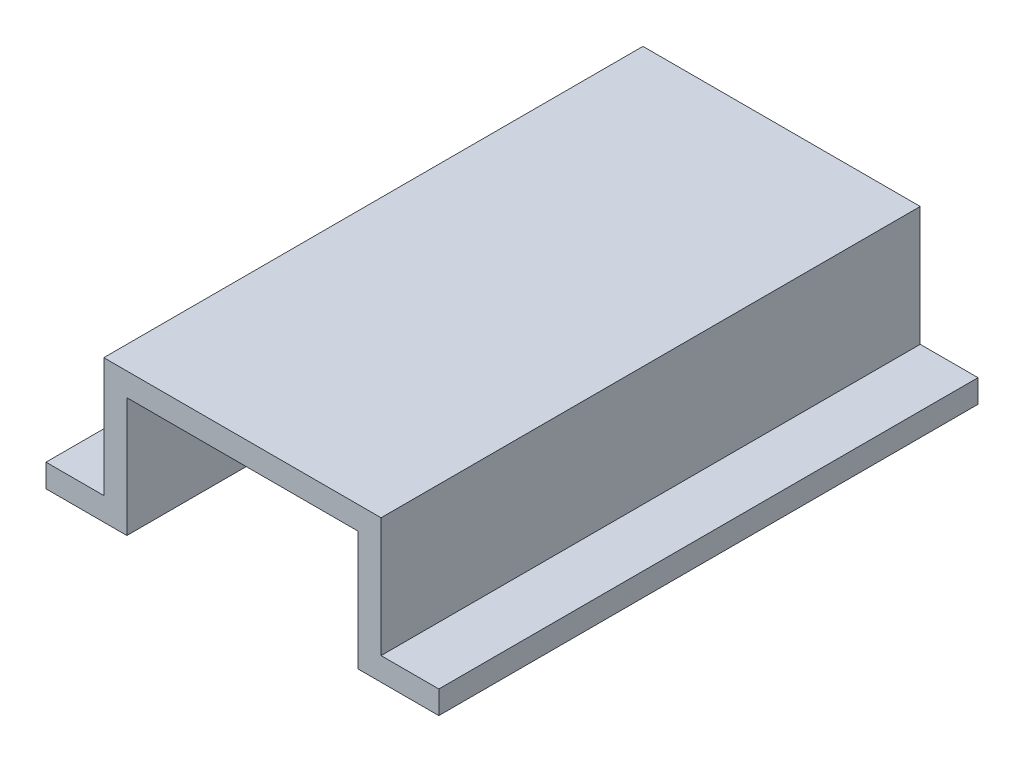
ISO-10303-21;
HEADER;
FILE_DESCRIPTION(('STEP AP214'),'2;1');
FILE_NAME('part.step','',(''),(''),'','','');
FILE_SCHEMA(('AUTOMOTIVE_DESIGN { 1 0 10303 214 1 1 1 1 }'));
ENDSEC;
DATA;
#1=APPLICATION_CONTEXT('core data for automotive mechanical design processes');
#2=APPLICATION_PROTOCOL_DEFINITION('international standard','automotive_design',2000,#1);
#3=PRODUCT_CONTEXT('',#1,'mechanical');
#4=PRODUCT('Part','Part','',(#3));
#5=PRODUCT_RELATED_PRODUCT_CATEGORY('part','',(#4));
#6=PRODUCT_DEFINITION_FORMATION('','',#4);
#7=PRODUCT_DEFINITION_CONTEXT('part definition',#1,'design');
#8=PRODUCT_DEFINITION('design','',#6,#7);
#9=PRODUCT_DEFINITION_SHAPE('','',#8);
#10=(LENGTH_UNIT() NAMED_UNIT(*) SI_UNIT(.MILLI.,.METRE.));
#11=(NAMED_UNIT(*) PLANE_ANGLE_UNIT() SI_UNIT($,.RADIAN.));
#12=(NAMED_UNIT(*) SI_UNIT($,.STERADIAN.) SOLID_ANGLE_UNIT());
#13=UNCERTAINTY_MEASURE_WITH_UNIT(LENGTH_MEASURE(1.E-05),#10,'distance_accuracy_value','');
#14=(GEOMETRIC_REPRESENTATION_CONTEXT(3) GLOBAL_UNCERTAINTY_ASSIGNED_CONTEXT((#13)) GLOBAL_UNIT_ASSIGNED_CONTEXT((#10,
#11,#12)) REPRESENTATION_CONTEXT('',''));
#15=CARTESIAN_POINT('',(0.,0.,0.));
#16=DIRECTION('',(0.,0.,1.));
#17=DIRECTION('',(1.,0.,0.));
#18=AXIS2_PLACEMENT_3D('',#15,#16,#17);
#19=CARTESIAN_POINT('',(0.,-6.,-140.));
#20=DIRECTION('',(1.,0.,0.));
#21=DIRECTION('',(0.,0.,1.));
#22=AXIS2_PLACEMENT_3D('',#19,#20,#21);
#23=PLANE('',#22);
#24=DIRECTION('',(0.,-1.,0.));
#25=VECTOR('',#24,1.);
#26=CARTESIAN_POINT('',(0.,-6.,0.));
#27=LINE('',#26,#25);
#28=CARTESIAN_POINT('',(0.,0.,0.));
#29=VERTEX_POINT('',#28);
#30=CARTESIAN_POINT('',(0.,-6.,0.));
#31=VERTEX_POINT('',#30);
#32=EDGE_CURVE('E157',#29,#31,#27,.T.);
#33=ORIENTED_EDGE('',*,*,#32,.F.);
#34=DIRECTION('',(0.,0.,1.));
#35=VECTOR('',#34,1.);
#36=CARTESIAN_POINT('',(0.,0.,-140.));
#37=LINE('',#36,#35);
#38=CARTESIAN_POINT('',(0.,0.,-140.));
#39=VERTEX_POINT('',#38);
#40=EDGE_CURVE('E156',#39,#29,#37,.T.);
#41=ORIENTED_EDGE('',*,*,#40,.F.);
#42=DIRECTION('',(0.,-1.,0.));
#43=VECTOR('',#42,1.);
#44=CARTESIAN_POINT('',(0.,-6.,-140.));
#45=LINE('',#44,#43);
#46=CARTESIAN_POINT('',(0.,-6.,-140.));
#47=VERTEX_POINT('',#46);
#48=EDGE_CURVE('E187',#39,#47,#45,.T.);
#49=ORIENTED_EDGE('',*,*,#48,.T.);
#50=DIRECTION('',(0.,0.,1.));
#51=VECTOR('',#50,1.);
#52=CARTESIAN_POINT('',(0.,-6.,-140.));
#53=LINE('',#52,#51);
#54=EDGE_CURVE('E11',#47,#31,#53,.T.);
#55=ORIENTED_EDGE('',*,*,#54,.T.);
#56=EDGE_LOOP('',(#33,#41,#49,#55));
#57=FACE_BOUND('',#56,.T.);
#58=ADVANCED_FACE('F37',(#57),#23,.F.);
#59=CARTESIAN_POINT('',(21.,-6.,-140.));
#60=DIRECTION('',(0.,1.,0.));
#61=DIRECTION('',(-1.,0.,0.));
#62=AXIS2_PLACEMENT_3D('',#59,#60,#61);
#63=PLANE('',#62);
#64=DIRECTION('',(1.,0.,0.));
#65=VECTOR('',#64,1.);
#66=CARTESIAN_POINT('',(21.,-6.,0.));
#67=LINE('',#66,#65);
#68=CARTESIAN_POINT('',(21.,-6.,0.));
#69=VERTEX_POINT('',#68);
#70=EDGE_CURVE('E159',#31,#69,#67,.T.);
#71=ORIENTED_EDGE('',*,*,#70,.F.);
#72=ORIENTED_EDGE('',*,*,#54,.F.);
#73=DIRECTION('',(1.,0.,0.));
#74=VECTOR('',#73,1.);
#75=CARTESIAN_POINT('',(21.,-6.,-140.));
#76=LINE('',#75,#74);
#77=CARTESIAN_POINT('',(21.,-6.,-140.));
#78=VERTEX_POINT('',#77);
#79=EDGE_CURVE('E103',#47,#78,#76,.T.);
#80=ORIENTED_EDGE('',*,*,#79,.T.);
#81=DIRECTION('',(0.,0.,1.));
#82=VECTOR('',#81,1.);
#83=CARTESIAN_POINT('',(21.,-6.,-140.));
#84=LINE('',#83,#82);
#85=EDGE_CURVE('E45',#78,#69,#84,.T.);
#86=ORIENTED_EDGE('',*,*,#85,.T.);
#87=EDGE_LOOP('',(#71,#72,#80,#86));
#88=FACE_BOUND('',#87,.T.);
#89=ADVANCED_FACE('F211',(#88),#63,.F.);
#90=CARTESIAN_POINT('',(21.,25.,-140.));
#91=DIRECTION('',(-1.,0.,0.));
#92=DIRECTION('',(0.,-1.,0.));
#93=AXIS2_PLACEMENT_3D('',#90,#91,#92);
#94=PLANE('',#93);
#95=DIRECTION('',(0.,1.,0.));
#96=VECTOR('',#95,1.);
#97=CARTESIAN_POINT('',(21.,25.,0.));
#98=LINE('',#97,#96);
#99=CARTESIAN_POINT('',(21.,25.,0.));
#100=VERTEX_POINT('',#99);
#101=EDGE_CURVE('E162',#69,#100,#98,.T.);
#102=ORIENTED_EDGE('',*,*,#101,.F.);
#103=ORIENTED_EDGE('',*,*,#85,.F.);
#104=DIRECTION('',(0.,1.,0.));
#105=VECTOR('',#104,1.);
#106=CARTESIAN_POINT('',(21.,25.,-140.));
#107=LINE('',#106,#105);
#108=CARTESIAN_POINT('',(21.,25.,-140.));
#109=VERTEX_POINT('',#108);
#110=EDGE_CURVE('E220',#78,#109,#107,.T.);
#111=ORIENTED_EDGE('',*,*,#110,.T.);
#112=DIRECTION('',(0.,0.,1.));
#113=VECTOR('',#112,1.);
#114=CARTESIAN_POINT('',(21.,25.,-140.));
#115=LINE('',#114,#113);
#116=EDGE_CURVE('E206',#109,#100,#115,.T.);
#117=ORIENTED_EDGE('',*,*,#116,.T.);
#118=EDGE_LOOP('',(#102,#103,#111,#117));
#119=FACE_BOUND('',#118,.T.);
#120=ADVANCED_FACE('F254',(#119),#94,.F.);
#121=CARTESIAN_POINT('',(81.,25.,-140.));
#122=DIRECTION('',(0.,1.,0.));
#123=DIRECTION('',(-1.,0.,0.));
#124=AXIS2_PLACEMENT_3D('',#121,#122,#123);
#125=PLANE('',#124);
#126=DIRECTION('',(1.,0.,0.));
#127=VECTOR('',#126,1.);
#128=CARTESIAN_POINT('',(81.,25.,0.));
#129=LINE('',#128,#127);
#130=CARTESIAN_POINT('',(81.,25.,0.));
#131=VERTEX_POINT('',#130);
#132=EDGE_CURVE('E165',#100,#131,#129,.T.);
#133=ORIENTED_EDGE('',*,*,#132,.F.);
#134=ORIENTED_EDGE('',*,*,#116,.F.);
#135=DIRECTION('',(1.,0.,0.));
#136=VECTOR('',#135,1.);
#137=CARTESIAN_POINT('',(81.,25.,-140.));
#138=LINE('',#137,#136);
#139=CARTESIAN_POINT('',(81.,25.,-140.));
#140=VERTEX_POINT('',#139);
#141=EDGE_CURVE('E224',#109,#140,#138,.T.);
#142=ORIENTED_EDGE('',*,*,#141,.T.);
#143=DIRECTION('',(0.,0.,1.));
#144=VECTOR('',#143,1.);
#145=CARTESIAN_POINT('',(81.,25.,-140.));
#146=LINE('',#145,#144);
#147=EDGE_CURVE('E203',#140,#131,#146,.T.);
#148=ORIENTED_EDGE('',*,*,#147,.T.);
#149=EDGE_LOOP('',(#133,#134,#142,#148));
#150=FACE_BOUND('',#149,.T.);
#151=ADVANCED_FACE('F253',(#150),#125,.F.);
#152=CARTESIAN_POINT('',(81.,-6.,-140.));
#153=DIRECTION('',(1.,0.,0.));
#154=DIRECTION('',(0.,1.,0.));
#155=AXIS2_PLACEMENT_3D('',#152,#153,#154);
#156=PLANE('',#155);
#157=DIRECTION('',(0.,-1.,0.));
#158=VECTOR('',#157,1.);
#159=CARTESIAN_POINT('',(81.,-6.,0.));
#160=LINE('',#159,#158);
#161=CARTESIAN_POINT('',(81.,-6.,0.));
#162=VERTEX_POINT('',#161);
#163=EDGE_CURVE('E168',#131,#162,#160,.T.);
#164=ORIENTED_EDGE('',*,*,#163,.F.);
#165=ORIENTED_EDGE('',*,*,#147,.F.);
#166=DIRECTION('',(0.,-1.,0.));
#167=VECTOR('',#166,1.);
#168=CARTESIAN_POINT('',(81.,-6.,-140.));
#169=LINE('',#168,#167);
#170=CARTESIAN_POINT('',(81.,-6.,-140.));
#171=VERTEX_POINT('',#170);
#172=EDGE_CURVE('E227',#140,#171,#169,.T.);
#173=ORIENTED_EDGE('',*,*,#172,.T.);
#174=DIRECTION('',(0.,0.,1.));
#175=VECTOR('',#174,1.);
#176=CARTESIAN_POINT('',(81.,-6.,-140.));
#177=LINE('',#176,#175);
#178=EDGE_CURVE('E200',#171,#162,#177,.T.);
#179=ORIENTED_EDGE('',*,*,#178,.T.);
#180=EDGE_LOOP('',(#164,#165,#173,#179));
#181=FACE_BOUND('',#180,.T.);
#182=ADVANCED_FACE('F251',(#181),#156,.F.);
#183=CARTESIAN_POINT('',(102.,-6.,-140.));
#184=DIRECTION('',(0.,1.,0.));
#185=DIRECTION('',(-1.,0.,0.));
#186=AXIS2_PLACEMENT_3D('',#183,#184,#185);
#187=PLANE('',#186);
#188=DIRECTION('',(1.,0.,0.));
#189=VECTOR('',#188,1.);
#190=CARTESIAN_POINT('',(102.,-6.,0.));
#191=LINE('',#190,#189);
#192=CARTESIAN_POINT('',(102.,-6.,0.));
#193=VERTEX_POINT('',#192);
#194=EDGE_CURVE('E171',#162,#193,#191,.T.);
#195=ORIENTED_EDGE('',*,*,#194,.F.);
#196=ORIENTED_EDGE('',*,*,#178,.F.);
#197=DIRECTION('',(1.,0.,0.));
#198=VECTOR('',#197,1.);
#199=CARTESIAN_POINT('',(102.,-6.,-140.));
#200=LINE('',#199,#198);
#201=CARTESIAN_POINT('',(102.,-6.,-140.));
#202=VERTEX_POINT('',#201);
#203=EDGE_CURVE('E230',#171,#202,#200,.T.);
#204=ORIENTED_EDGE('',*,*,#203,.T.);
#205=DIRECTION('',(0.,0.,1.));
#206=VECTOR('',#205,1.);
#207=CARTESIAN_POINT('',(102.,-6.,-140.));
#208=LINE('',#207,#206);
#209=EDGE_CURVE('E197',#202,#193,#208,.T.);
#210=ORIENTED_EDGE('',*,*,#209,.T.);
#211=EDGE_LOOP('',(#195,#196,#204,#210));
#212=FACE_BOUND('',#211,.T.);
#213=ADVANCED_FACE('F247',(#212),#187,.F.);
#214=CARTESIAN_POINT('',(102.,0.,-140.));
#215=DIRECTION('',(-1.,0.,0.));
#216=DIRECTION('',(0.,0.,-1.));
#217=AXIS2_PLACEMENT_3D('',#214,#215,#216);
#218=PLANE('',#217);
#219=DIRECTION('',(0.,1.,0.));
#220=VECTOR('',#219,1.);
#221=CARTESIAN_POINT('',(102.,0.,0.));
#222=LINE('',#221,#220);
#223=CARTESIAN_POINT('',(102.,0.,0.));
#224=VERTEX_POINT('',#223);
#225=EDGE_CURVE('E174',#193,#224,#222,.T.);
#226=ORIENTED_EDGE('',*,*,#225,.F.);
#227=ORIENTED_EDGE('',*,*,#209,.F.);
#228=DIRECTION('',(0.,1.,0.));
#229=VECTOR('',#228,1.);
#230=CARTESIAN_POINT('',(102.,0.,-140.));
#231=LINE('',#230,#229);
#232=CARTESIAN_POINT('',(102.,0.,-140.));
#233=VERTEX_POINT('',#232);
#234=EDGE_CURVE('E233',#202,#233,#231,.T.);
#235=ORIENTED_EDGE('',*,*,#234,.T.);
#236=DIRECTION('',(0.,0.,1.));
#237=VECTOR('',#236,1.);
#238=CARTESIAN_POINT('',(102.,0.,-140.));
#239=LINE('',#238,#237);
#240=EDGE_CURVE('E194',#233,#224,#239,.T.);
#241=ORIENTED_EDGE('',*,*,#240,.T.);
#242=EDGE_LOOP('',(#226,#227,#235,#241));
#243=FACE_BOUND('',#242,.T.);
#244=ADVANCED_FACE('F244',(#243),#218,.F.);
#245=CARTESIAN_POINT('',(87.,0.,-140.));
#246=DIRECTION('',(0.,-1.,0.));
#247=DIRECTION('',(1.,0.,0.));
#248=AXIS2_PLACEMENT_3D('',#245,#246,#247);
#249=PLANE('',#248);
#250=DIRECTION('',(-1.,0.,0.));
#251=VECTOR('',#250,1.);
#252=CARTESIAN_POINT('',(87.,0.,0.));
#253=LINE('',#252,#251);
#254=CARTESIAN_POINT('',(87.,0.,0.));
#255=VERTEX_POINT('',#254);
#256=EDGE_CURVE('E177',#224,#255,#253,.T.);
#257=ORIENTED_EDGE('',*,*,#256,.F.);
#258=ORIENTED_EDGE('',*,*,#240,.F.);
#259=DIRECTION('',(-1.,0.,0.));
#260=VECTOR('',#259,1.);
#261=CARTESIAN_POINT('',(87.,0.,-140.));
#262=LINE('',#261,#260);
#263=CARTESIAN_POINT('',(87.,0.,-140.));
#264=VERTEX_POINT('',#263);
#265=EDGE_CURVE('E151',#233,#264,#262,.T.);
#266=ORIENTED_EDGE('',*,*,#265,.T.);
#267=DIRECTION('',(0.,0.,1.));
#268=VECTOR('',#267,1.);
#269=CARTESIAN_POINT('',(87.,0.,-140.));
#270=LINE('',#269,#268);
#271=EDGE_CURVE('E191',#264,#255,#270,.T.);
#272=ORIENTED_EDGE('',*,*,#271,.T.);
#273=EDGE_LOOP('',(#257,#258,#266,#272));
#274=FACE_BOUND('',#273,.T.);
#275=ADVANCED_FACE('F238',(#274),#249,.F.);
#276=CARTESIAN_POINT('',(87.,31.,-140.));
#277=DIRECTION('',(-1.,0.,0.));
#278=DIRECTION('',(0.,0.,-1.));
#279=AXIS2_PLACEMENT_3D('',#276,#277,#278);
#280=PLANE('',#279);
#281=DIRECTION('',(0.,1.,0.));
#282=VECTOR('',#281,1.);
#283=CARTESIAN_POINT('',(87.,31.,0.));
#284=LINE('',#283,#282);
#285=CARTESIAN_POINT('',(87.,31.,0.));
#286=VERTEX_POINT('',#285);
#287=EDGE_CURVE('E180',#255,#286,#284,.T.);
#288=ORIENTED_EDGE('',*,*,#287,.F.);
#289=ORIENTED_EDGE('',*,*,#271,.F.);
#290=DIRECTION('',(0.,1.,0.));
#291=VECTOR('',#290,1.);
#292=CARTESIAN_POINT('',(87.,31.,-140.));
#293=LINE('',#292,#291);
#294=CARTESIAN_POINT('',(87.,31.,-140.));
#295=VERTEX_POINT('',#294);
#296=EDGE_CURVE('E149',#264,#295,#293,.T.);
#297=ORIENTED_EDGE('',*,*,#296,.T.);
#298=DIRECTION('',(0.,0.,1.));
#299=VECTOR('',#298,1.);
#300=CARTESIAN_POINT('',(87.,31.,-140.));
#301=LINE('',#300,#299);
#302=EDGE_CURVE('E143',#295,#286,#301,.T.);
#303=ORIENTED_EDGE('',*,*,#302,.T.);
#304=EDGE_LOOP('',(#288,#289,#297,#303));
#305=FACE_BOUND('',#304,.T.);
#306=ADVANCED_FACE('F242',(#305),#280,.F.);
#307=CARTESIAN_POINT('',(15.,31.,-140.));
#308=DIRECTION('',(0.,-1.,0.));
#309=DIRECTION('',(0.,0.,1.));
#310=AXIS2_PLACEMENT_3D('',#307,#308,#309);
#311=PLANE('',#310);
#312=DIRECTION('',(-1.,0.,0.));
#313=VECTOR('',#312,1.);
#314=CARTESIAN_POINT('',(15.,31.,0.));
#315=LINE('',#314,#313);
#316=CARTESIAN_POINT('',(15.,31.,0.));
#317=VERTEX_POINT('',#316);
#318=EDGE_CURVE('E183',#286,#317,#315,.T.);
#319=ORIENTED_EDGE('',*,*,#318,.F.);
#320=ORIENTED_EDGE('',*,*,#302,.F.);
#321=DIRECTION('',(-1.,0.,0.));
#322=VECTOR('',#321,1.);
#323=CARTESIAN_POINT('',(15.,31.,-140.));
#324=LINE('',#323,#322);
#325=CARTESIAN_POINT('',(15.,31.,-140.));
#326=VERTEX_POINT('',#325);
#327=EDGE_CURVE('E133',#295,#326,#324,.T.);
#328=ORIENTED_EDGE('',*,*,#327,.T.);
#329=DIRECTION('',(0.,0.,1.));
#330=VECTOR('',#329,1.);
#331=CARTESIAN_POINT('',(15.,31.,-140.));
#332=LINE('',#331,#330);
#333=EDGE_CURVE('E138',#326,#317,#332,.T.);
#334=ORIENTED_EDGE('',*,*,#333,.T.);
#335=EDGE_LOOP('',(#319,#320,#328,#334));
#336=FACE_BOUND('',#335,.T.);
#337=ADVANCED_FACE('F146',(#336),#311,.F.);
#338=CARTESIAN_POINT('',(15.,0.,-140.));
#339=DIRECTION('',(1.,0.,0.));
#340=DIRECTION('',(0.,0.,1.));
#341=AXIS2_PLACEMENT_3D('',#338,#339,#340);
#342=PLANE('',#341);
#343=DIRECTION('',(0.,-1.,0.));
#344=VECTOR('',#343,1.);
#345=CARTESIAN_POINT('',(15.,0.,0.));
#346=LINE('',#345,#344);
#347=CARTESIAN_POINT('',(15.,0.,0.));
#348=VERTEX_POINT('',#347);
#349=EDGE_CURVE('E140',#317,#348,#346,.T.);
#350=ORIENTED_EDGE('',*,*,#349,.F.);
#351=ORIENTED_EDGE('',*,*,#333,.F.);
#352=DIRECTION('',(0.,-1.,0.));
#353=VECTOR('',#352,1.);
#354=CARTESIAN_POINT('',(15.,0.,-140.));
#355=LINE('',#354,#353);
#356=CARTESIAN_POINT('',(15.,0.,-140.));
#357=VERTEX_POINT('',#356);
#358=EDGE_CURVE('E129',#326,#357,#355,.T.);
#359=ORIENTED_EDGE('',*,*,#358,.T.);
#360=DIRECTION('',(0.,0.,1.));
#361=VECTOR('',#360,1.);
#362=CARTESIAN_POINT('',(15.,0.,-140.));
#363=LINE('',#362,#361);
#364=EDGE_CURVE('E144',#357,#348,#363,.T.);
#365=ORIENTED_EDGE('',*,*,#364,.T.);
#366=EDGE_LOOP('',(#350,#351,#359,#365));
#367=FACE_BOUND('',#366,.T.);
#368=ADVANCED_FACE('F139',(#367),#342,.F.);
#369=CARTESIAN_POINT('',(0.,0.,-140.));
#370=DIRECTION('',(0.,-1.,0.));
#371=DIRECTION('',(0.,0.,1.));
#372=AXIS2_PLACEMENT_3D('',#369,#370,#371);
#373=PLANE('',#372);
#374=DIRECTION('',(-1.,0.,0.));
#375=VECTOR('',#374,1.);
#376=CARTESIAN_POINT('',(0.,0.,0.));
#377=LINE('',#376,#375);
#378=EDGE_CURVE('E91',#348,#29,#377,.T.);
#379=ORIENTED_EDGE('',*,*,#378,.F.);
#380=ORIENTED_EDGE('',*,*,#364,.F.);
#381=DIRECTION('',(-1.,0.,0.));
#382=VECTOR('',#381,1.);
#383=CARTESIAN_POINT('',(0.,0.,-140.));
#384=LINE('',#383,#382);
#385=EDGE_CURVE('E53',#357,#39,#384,.T.);
#386=ORIENTED_EDGE('',*,*,#385,.T.);
#387=ORIENTED_EDGE('',*,*,#40,.T.);
#388=EDGE_LOOP('',(#379,#380,#386,#387));
#389=FACE_BOUND('',#388,.T.);
#390=ADVANCED_FACE('F336',(#389),#373,.F.);
#391=CARTESIAN_POINT('',(0.,0.,-140.));
#392=DIRECTION('',(0.,0.,1.));
#393=DIRECTION('',(-1.,0.,0.));
#394=AXIS2_PLACEMENT_3D('',#391,#392,#393);
#395=PLANE('',#394);
#396=ORIENTED_EDGE('',*,*,#48,.F.);
#397=ORIENTED_EDGE('',*,*,#385,.F.);
#398=ORIENTED_EDGE('',*,*,#358,.F.);
#399=ORIENTED_EDGE('',*,*,#327,.F.);
#400=ORIENTED_EDGE('',*,*,#296,.F.);
#401=ORIENTED_EDGE('',*,*,#265,.F.);
#402=ORIENTED_EDGE('',*,*,#234,.F.);
#403=ORIENTED_EDGE('',*,*,#203,.F.);
#404=ORIENTED_EDGE('',*,*,#172,.F.);
#405=ORIENTED_EDGE('',*,*,#141,.F.);
#406=ORIENTED_EDGE('',*,*,#110,.F.);
#407=ORIENTED_EDGE('',*,*,#79,.F.);
#408=EDGE_LOOP('',(#396,#397,#398,#399,#400,#401,#402,#403,#404,#405,#406,#407));
#409=FACE_BOUND('',#408,.T.);
#410=ADVANCED_FACE('F131',(#409),#395,.F.);
#411=CARTESIAN_POINT('',(0.,0.,0.));
#412=DIRECTION('',(0.,0.,1.));
#413=DIRECTION('',(-1.,0.,0.));
#414=AXIS2_PLACEMENT_3D('',#411,#412,#413);
#415=PLANE('',#414);
#416=ORIENTED_EDGE('',*,*,#32,.T.);
#417=ORIENTED_EDGE('',*,*,#70,.T.);
#418=ORIENTED_EDGE('',*,*,#101,.T.);
#419=ORIENTED_EDGE('',*,*,#132,.T.);
#420=ORIENTED_EDGE('',*,*,#163,.T.);
#421=ORIENTED_EDGE('',*,*,#194,.T.);
#422=ORIENTED_EDGE('',*,*,#225,.T.);
#423=ORIENTED_EDGE('',*,*,#256,.T.);
#424=ORIENTED_EDGE('',*,*,#287,.T.);
#425=ORIENTED_EDGE('',*,*,#318,.T.);
#426=ORIENTED_EDGE('',*,*,#349,.T.);
#427=ORIENTED_EDGE('',*,*,#378,.T.);
#428=EDGE_LOOP('',(#416,#417,#418,#419,#420,#421,#422,#423,#424,#425,#426,#427));
#429=FACE_BOUND('',#428,.T.);
#430=ADVANCED_FACE('F214',(#429),#415,.T.);
#431=CLOSED_SHELL('',(#58,#89,#120,#151,#182,#213,#244,#275,#306,#337,#368,#390,#410,#430));
#432=MANIFOLD_SOLID_BREP('B2',#431);
#433=ADVANCED_BREP_SHAPE_REPRESENTATION('',(#18,#432),#14);
#434=SHAPE_DEFINITION_REPRESENTATION(#9,#433);
ENDSEC;
END-ISO-10303-21;
